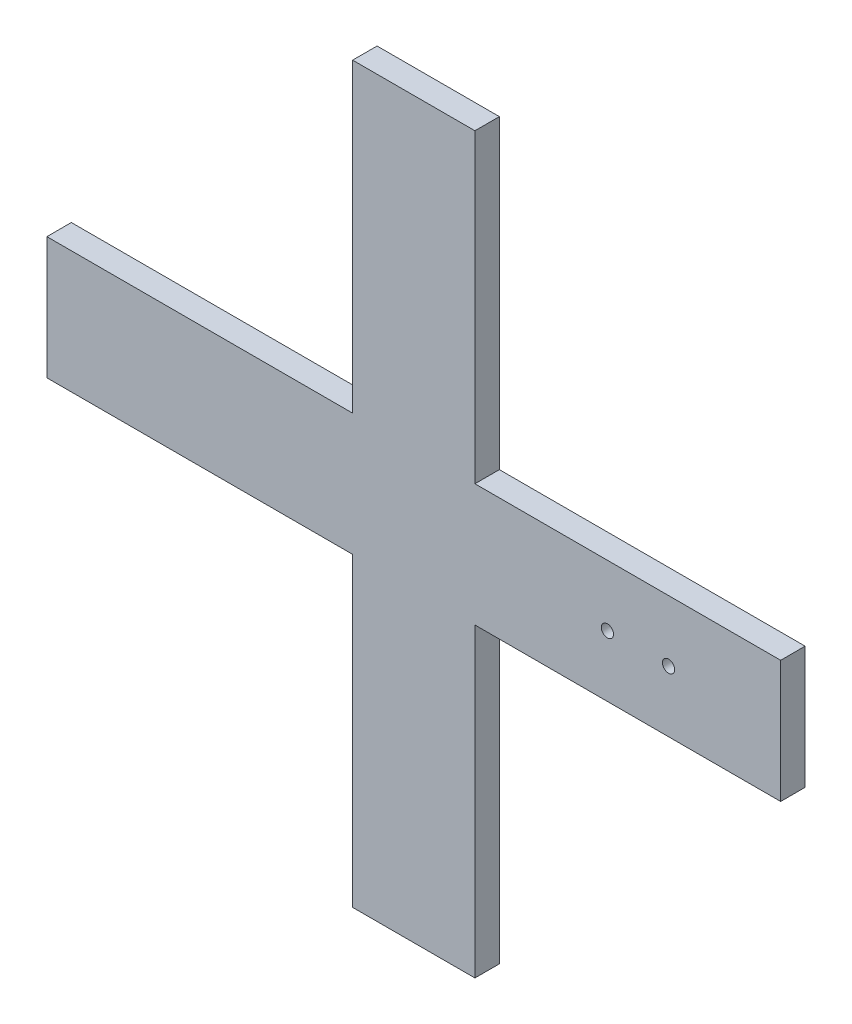
ISO-10303-21;
HEADER;
FILE_DESCRIPTION(('STEP AP214'),'2;1');
FILE_NAME('part.step','',(''),(''),'','','');
FILE_SCHEMA(('AUTOMOTIVE_DESIGN { 1 0 10303 214 1 1 1 1 }'));
ENDSEC;
DATA;
#1=APPLICATION_CONTEXT('core data for automotive mechanical design processes');
#2=APPLICATION_PROTOCOL_DEFINITION('international standard','automotive_design',2000,#1);
#3=PRODUCT_CONTEXT('',#1,'mechanical');
#4=PRODUCT('Part','Part','',(#3));
#5=PRODUCT_RELATED_PRODUCT_CATEGORY('part','',(#4));
#6=PRODUCT_DEFINITION_FORMATION('','',#4);
#7=PRODUCT_DEFINITION_CONTEXT('part definition',#1,'design');
#8=PRODUCT_DEFINITION('design','',#6,#7);
#9=PRODUCT_DEFINITION_SHAPE('','',#8);
#10=(LENGTH_UNIT() NAMED_UNIT(*) SI_UNIT(.MILLI.,.METRE.));
#11=(NAMED_UNIT(*) PLANE_ANGLE_UNIT() SI_UNIT($,.RADIAN.));
#12=(NAMED_UNIT(*) SI_UNIT($,.STERADIAN.) SOLID_ANGLE_UNIT());
#13=UNCERTAINTY_MEASURE_WITH_UNIT(LENGTH_MEASURE(1.E-05),#10,'distance_accuracy_value','');
#14=(GEOMETRIC_REPRESENTATION_CONTEXT(3) GLOBAL_UNCERTAINTY_ASSIGNED_CONTEXT((#13)) GLOBAL_UNIT_ASSIGNED_CONTEXT((#10,
#11,#12)) REPRESENTATION_CONTEXT('',''));
#15=CARTESIAN_POINT('',(0.,0.,0.));
#16=DIRECTION('',(0.,0.,1.));
#17=DIRECTION('',(1.,0.,0.));
#18=AXIS2_PLACEMENT_3D('',#15,#16,#17);
#19=CARTESIAN_POINT('',(0.,75.,6.));
#20=DIRECTION('',(0.,1.,0.));
#21=DIRECTION('',(0.,0.,1.));
#22=AXIS2_PLACEMENT_3D('',#19,#20,#21);
#23=PLANE('',#22);
#24=DIRECTION('',(1.,0.,0.));
#25=VECTOR('',#24,1.);
#26=CARTESIAN_POINT('',(0.,75.,0.));
#27=LINE('',#26,#25);
#28=CARTESIAN_POINT('',(0.,75.,0.));
#29=VERTEX_POINT('',#28);
#30=CARTESIAN_POINT('',(75.0000000000011,75.,0.));
#31=VERTEX_POINT('',#30);
#32=EDGE_CURVE('E167',#29,#31,#27,.T.);
#33=ORIENTED_EDGE('',*,*,#32,.T.);
#34=DIRECTION('',(0.,0.,-1.));
#35=VECTOR('',#34,1.);
#36=CARTESIAN_POINT('',(75.0000000000011,75.,6.));
#37=LINE('',#36,#35);
#38=CARTESIAN_POINT('',(75.0000000000011,75.,6.));
#39=VERTEX_POINT('',#38);
#40=EDGE_CURVE('E11',#39,#31,#37,.T.);
#41=ORIENTED_EDGE('',*,*,#40,.F.);
#42=DIRECTION('',(1.,0.,0.));
#43=VECTOR('',#42,1.);
#44=CARTESIAN_POINT('',(0.,75.,6.));
#45=LINE('',#44,#43);
#46=CARTESIAN_POINT('',(0.,75.,6.));
#47=VERTEX_POINT('',#46);
#48=EDGE_CURVE('E403',#47,#39,#45,.T.);
#49=ORIENTED_EDGE('',*,*,#48,.F.);
#50=DIRECTION('',(0.,0.,-1.));
#51=VECTOR('',#50,1.);
#52=CARTESIAN_POINT('',(0.,75.,6.));
#53=LINE('',#52,#51);
#54=EDGE_CURVE('E56',#47,#29,#53,.T.);
#55=ORIENTED_EDGE('',*,*,#54,.T.);
#56=EDGE_LOOP('',(#33,#41,#49,#55));
#57=FACE_BOUND('',#56,.T.);
#58=ADVANCED_FACE('F39',(#57),#23,.F.);
#59=CARTESIAN_POINT('',(75.0000000000011,0.,6.));
#60=DIRECTION('',(1.,0.,0.));
#61=DIRECTION('',(0.,0.,-1.));
#62=AXIS2_PLACEMENT_3D('',#59,#60,#61);
#63=PLANE('',#62);
#64=DIRECTION('',(0.,-1.,0.));
#65=VECTOR('',#64,1.);
#66=CARTESIAN_POINT('',(75.0000000000011,0.,0.));
#67=LINE('',#66,#65);
#68=CARTESIAN_POINT('',(75.0000000000011,0.,0.));
#69=VERTEX_POINT('',#68);
#70=EDGE_CURVE('E169',#31,#69,#67,.T.);
#71=ORIENTED_EDGE('',*,*,#70,.T.);
#72=DIRECTION('',(0.,0.,-1.));
#73=VECTOR('',#72,1.);
#74=CARTESIAN_POINT('',(75.0000000000011,0.,6.));
#75=LINE('',#74,#73);
#76=CARTESIAN_POINT('',(75.0000000000011,0.,6.));
#77=VERTEX_POINT('',#76);
#78=EDGE_CURVE('E48',#77,#69,#75,.T.);
#79=ORIENTED_EDGE('',*,*,#78,.F.);
#80=DIRECTION('',(0.,-1.,0.));
#81=VECTOR('',#80,1.);
#82=CARTESIAN_POINT('',(75.0000000000011,0.,6.));
#83=LINE('',#82,#81);
#84=EDGE_CURVE('E106',#39,#77,#83,.T.);
#85=ORIENTED_EDGE('',*,*,#84,.F.);
#86=ORIENTED_EDGE('',*,*,#40,.T.);
#87=EDGE_LOOP('',(#71,#79,#85,#86));
#88=FACE_BOUND('',#87,.T.);
#89=ADVANCED_FACE('F262',(#88),#63,.F.);
#90=CARTESIAN_POINT('',(0.,0.,6.));
#91=DIRECTION('',(0.,1.,0.));
#92=DIRECTION('',(0.,0.,1.));
#93=AXIS2_PLACEMENT_3D('',#90,#91,#92);
#94=PLANE('',#93);
#95=DIRECTION('',(1.,0.,0.));
#96=VECTOR('',#95,1.);
#97=CARTESIAN_POINT('',(0.,0.,0.));
#98=LINE('',#97,#96);
#99=CARTESIAN_POINT('',(105.000000000001,0.,0.));
#100=VERTEX_POINT('',#99);
#101=EDGE_CURVE('E171',#69,#100,#98,.T.);
#102=ORIENTED_EDGE('',*,*,#101,.T.);
#103=DIRECTION('',(0.,0.,-1.));
#104=VECTOR('',#103,1.);
#105=CARTESIAN_POINT('',(105.000000000001,0.,6.));
#106=LINE('',#105,#104);
#107=CARTESIAN_POINT('',(105.000000000001,0.,6.));
#108=VERTEX_POINT('',#107);
#109=EDGE_CURVE('E212',#108,#100,#106,.T.);
#110=ORIENTED_EDGE('',*,*,#109,.F.);
#111=DIRECTION('',(1.,0.,0.));
#112=VECTOR('',#111,1.);
#113=CARTESIAN_POINT('',(0.,0.,6.));
#114=LINE('',#113,#112);
#115=EDGE_CURVE('E219',#77,#108,#114,.T.);
#116=ORIENTED_EDGE('',*,*,#115,.F.);
#117=ORIENTED_EDGE('',*,*,#78,.T.);
#118=EDGE_LOOP('',(#102,#110,#116,#117));
#119=FACE_BOUND('',#118,.T.);
#120=ADVANCED_FACE('F217',(#119),#94,.F.);
#121=CARTESIAN_POINT('',(105.000000000001,0.,6.));
#122=DIRECTION('',(1.,0.,0.));
#123=DIRECTION('',(0.,0.,-1.));
#124=AXIS2_PLACEMENT_3D('',#121,#122,#123);
#125=PLANE('',#124);
#126=DIRECTION('',(0.,-1.,0.));
#127=VECTOR('',#126,1.);
#128=CARTESIAN_POINT('',(105.000000000001,0.,0.));
#129=LINE('',#128,#127);
#130=CARTESIAN_POINT('',(105.000000000001,75.,0.));
#131=VERTEX_POINT('',#130);
#132=EDGE_CURVE('E174',#131,#100,#129,.T.);
#133=ORIENTED_EDGE('',*,*,#132,.F.);
#134=DIRECTION('',(0.,0.,-1.));
#135=VECTOR('',#134,1.);
#136=CARTESIAN_POINT('',(105.000000000001,75.,6.));
#137=LINE('',#136,#135);
#138=CARTESIAN_POINT('',(105.000000000001,75.,6.));
#139=VERTEX_POINT('',#138);
#140=EDGE_CURVE('E210',#139,#131,#137,.T.);
#141=ORIENTED_EDGE('',*,*,#140,.F.);
#142=DIRECTION('',(0.,-1.,0.));
#143=VECTOR('',#142,1.);
#144=CARTESIAN_POINT('',(105.000000000001,0.,6.));
#145=LINE('',#144,#143);
#146=EDGE_CURVE('E230',#139,#108,#145,.T.);
#147=ORIENTED_EDGE('',*,*,#146,.T.);
#148=ORIENTED_EDGE('',*,*,#109,.T.);
#149=EDGE_LOOP('',(#133,#141,#147,#148));
#150=FACE_BOUND('',#149,.T.);
#151=ADVANCED_FACE('F226',(#150),#125,.T.);
#152=CARTESIAN_POINT('',(0.,75.,6.));
#153=DIRECTION('',(0.,1.,0.));
#154=DIRECTION('',(0.,0.,1.));
#155=AXIS2_PLACEMENT_3D('',#152,#153,#154);
#156=PLANE('',#155);
#157=DIRECTION('',(1.,0.,0.));
#158=VECTOR('',#157,1.);
#159=CARTESIAN_POINT('',(0.,75.,0.));
#160=LINE('',#159,#158);
#161=CARTESIAN_POINT('',(180.,75.,0.));
#162=VERTEX_POINT('',#161);
#163=EDGE_CURVE('E177',#131,#162,#160,.T.);
#164=ORIENTED_EDGE('',*,*,#163,.T.);
#165=DIRECTION('',(0.,0.,-1.));
#166=VECTOR('',#165,1.);
#167=CARTESIAN_POINT('',(180.,75.,6.));
#168=LINE('',#167,#166);
#169=CARTESIAN_POINT('',(180.,75.,6.));
#170=VERTEX_POINT('',#169);
#171=EDGE_CURVE('E207',#170,#162,#168,.T.);
#172=ORIENTED_EDGE('',*,*,#171,.F.);
#173=DIRECTION('',(1.,0.,0.));
#174=VECTOR('',#173,1.);
#175=CARTESIAN_POINT('',(0.,75.,6.));
#176=LINE('',#175,#174);
#177=EDGE_CURVE('E231',#139,#170,#176,.T.);
#178=ORIENTED_EDGE('',*,*,#177,.F.);
#179=ORIENTED_EDGE('',*,*,#140,.T.);
#180=EDGE_LOOP('',(#164,#172,#178,#179));
#181=FACE_BOUND('',#180,.T.);
#182=ADVANCED_FACE('F356',(#181),#156,.F.);
#183=CARTESIAN_POINT('',(180.,0.,6.));
#184=DIRECTION('',(-1.,0.,0.));
#185=DIRECTION('',(0.,0.,1.));
#186=AXIS2_PLACEMENT_3D('',#183,#184,#185);
#187=PLANE('',#186);
#188=DIRECTION('',(0.,1.,0.));
#189=VECTOR('',#188,1.);
#190=CARTESIAN_POINT('',(180.,0.,0.));
#191=LINE('',#190,#189);
#192=CARTESIAN_POINT('',(180.,105.,0.));
#193=VERTEX_POINT('',#192);
#194=EDGE_CURVE('E179',#162,#193,#191,.T.);
#195=ORIENTED_EDGE('',*,*,#194,.T.);
#196=DIRECTION('',(0.,0.,-1.));
#197=VECTOR('',#196,1.);
#198=CARTESIAN_POINT('',(180.,105.,6.));
#199=LINE('',#198,#197);
#200=CARTESIAN_POINT('',(180.,105.,6.));
#201=VERTEX_POINT('',#200);
#202=EDGE_CURVE('E205',#201,#193,#199,.T.);
#203=ORIENTED_EDGE('',*,*,#202,.F.);
#204=DIRECTION('',(0.,1.,0.));
#205=VECTOR('',#204,1.);
#206=CARTESIAN_POINT('',(180.,0.,6.));
#207=LINE('',#206,#205);
#208=EDGE_CURVE('E233',#170,#201,#207,.T.);
#209=ORIENTED_EDGE('',*,*,#208,.F.);
#210=ORIENTED_EDGE('',*,*,#171,.T.);
#211=EDGE_LOOP('',(#195,#203,#209,#210));
#212=FACE_BOUND('',#211,.T.);
#213=ADVANCED_FACE('F346',(#212),#187,.F.);
#214=CARTESIAN_POINT('',(0.,105.,6.));
#215=DIRECTION('',(0.,1.,0.));
#216=DIRECTION('',(0.,0.,1.));
#217=AXIS2_PLACEMENT_3D('',#214,#215,#216);
#218=PLANE('',#217);
#219=DIRECTION('',(1.,0.,0.));
#220=VECTOR('',#219,1.);
#221=CARTESIAN_POINT('',(0.,105.,0.));
#222=LINE('',#221,#220);
#223=CARTESIAN_POINT('',(105.,105.,0.));
#224=VERTEX_POINT('',#223);
#225=EDGE_CURVE('E182',#224,#193,#222,.T.);
#226=ORIENTED_EDGE('',*,*,#225,.F.);
#227=DIRECTION('',(0.,0.,-1.));
#228=VECTOR('',#227,1.);
#229=CARTESIAN_POINT('',(105.,105.,6.));
#230=LINE('',#229,#228);
#231=CARTESIAN_POINT('',(105.,105.,6.));
#232=VERTEX_POINT('',#231);
#233=EDGE_CURVE('E203',#232,#224,#230,.T.);
#234=ORIENTED_EDGE('',*,*,#233,.F.);
#235=DIRECTION('',(1.,0.,0.));
#236=VECTOR('',#235,1.);
#237=CARTESIAN_POINT('',(0.,105.,6.));
#238=LINE('',#237,#236);
#239=EDGE_CURVE('E239',#232,#201,#238,.T.);
#240=ORIENTED_EDGE('',*,*,#239,.T.);
#241=ORIENTED_EDGE('',*,*,#202,.T.);
#242=EDGE_LOOP('',(#226,#234,#240,#241));
#243=FACE_BOUND('',#242,.T.);
#244=ADVANCED_FACE('F336',(#243),#218,.T.);
#245=CARTESIAN_POINT('',(105.,0.,6.));
#246=DIRECTION('',(1.,0.,0.));
#247=DIRECTION('',(0.,0.,-1.));
#248=AXIS2_PLACEMENT_3D('',#245,#246,#247);
#249=PLANE('',#248);
#250=DIRECTION('',(0.,-1.,0.));
#251=VECTOR('',#250,1.);
#252=CARTESIAN_POINT('',(105.,0.,0.));
#253=LINE('',#252,#251);
#254=CARTESIAN_POINT('',(105.,180.,0.));
#255=VERTEX_POINT('',#254);
#256=EDGE_CURVE('E185',#255,#224,#253,.T.);
#257=ORIENTED_EDGE('',*,*,#256,.F.);
#258=DIRECTION('',(0.,0.,-1.));
#259=VECTOR('',#258,1.);
#260=CARTESIAN_POINT('',(105.,180.,6.));
#261=LINE('',#260,#259);
#262=CARTESIAN_POINT('',(105.,180.,6.));
#263=VERTEX_POINT('',#262);
#264=EDGE_CURVE('E201',#263,#255,#261,.T.);
#265=ORIENTED_EDGE('',*,*,#264,.F.);
#266=DIRECTION('',(0.,-1.,0.));
#267=VECTOR('',#266,1.);
#268=CARTESIAN_POINT('',(105.,0.,6.));
#269=LINE('',#268,#267);
#270=EDGE_CURVE('E242',#263,#232,#269,.T.);
#271=ORIENTED_EDGE('',*,*,#270,.T.);
#272=ORIENTED_EDGE('',*,*,#233,.T.);
#273=EDGE_LOOP('',(#257,#265,#271,#272));
#274=FACE_BOUND('',#273,.T.);
#275=ADVANCED_FACE('F327',(#274),#249,.T.);
#276=CARTESIAN_POINT('',(0.,180.,6.));
#277=DIRECTION('',(0.,1.,0.));
#278=DIRECTION('',(-1.,0.,0.));
#279=AXIS2_PLACEMENT_3D('',#276,#277,#278);
#280=PLANE('',#279);
#281=DIRECTION('',(1.,0.,0.));
#282=VECTOR('',#281,1.);
#283=CARTESIAN_POINT('',(0.,180.,0.));
#284=LINE('',#283,#282);
#285=CARTESIAN_POINT('',(75.,180.,0.));
#286=VERTEX_POINT('',#285);
#287=EDGE_CURVE('E188',#286,#255,#284,.T.);
#288=ORIENTED_EDGE('',*,*,#287,.F.);
#289=DIRECTION('',(0.,0.,-1.));
#290=VECTOR('',#289,1.);
#291=CARTESIAN_POINT('',(75.,180.,6.));
#292=LINE('',#291,#290);
#293=CARTESIAN_POINT('',(75.,180.,6.));
#294=VERTEX_POINT('',#293);
#295=EDGE_CURVE('E153',#294,#286,#292,.T.);
#296=ORIENTED_EDGE('',*,*,#295,.F.);
#297=DIRECTION('',(1.,0.,0.));
#298=VECTOR('',#297,1.);
#299=CARTESIAN_POINT('',(0.,180.,6.));
#300=LINE('',#299,#298);
#301=EDGE_CURVE('E143',#294,#263,#300,.T.);
#302=ORIENTED_EDGE('',*,*,#301,.T.);
#303=ORIENTED_EDGE('',*,*,#264,.T.);
#304=EDGE_LOOP('',(#288,#296,#302,#303));
#305=FACE_BOUND('',#304,.T.);
#306=ADVANCED_FACE('F246',(#305),#280,.T.);
#307=CARTESIAN_POINT('',(75.,0.,6.));
#308=DIRECTION('',(1.,0.,0.));
#309=DIRECTION('',(0.,0.,-1.));
#310=AXIS2_PLACEMENT_3D('',#307,#308,#309);
#311=PLANE('',#310);
#312=DIRECTION('',(0.,-1.,0.));
#313=VECTOR('',#312,1.);
#314=CARTESIAN_POINT('',(75.,0.,0.));
#315=LINE('',#314,#313);
#316=CARTESIAN_POINT('',(75.,105.,0.));
#317=VERTEX_POINT('',#316);
#318=EDGE_CURVE('E150',#286,#317,#315,.T.);
#319=ORIENTED_EDGE('',*,*,#318,.T.);
#320=DIRECTION('',(0.,0.,-1.));
#321=VECTOR('',#320,1.);
#322=CARTESIAN_POINT('',(75.,105.,6.));
#323=LINE('',#322,#321);
#324=CARTESIAN_POINT('',(75.,105.,6.));
#325=VERTEX_POINT('',#324);
#326=EDGE_CURVE('E147',#325,#317,#323,.T.);
#327=ORIENTED_EDGE('',*,*,#326,.F.);
#328=DIRECTION('',(0.,-1.,0.));
#329=VECTOR('',#328,1.);
#330=CARTESIAN_POINT('',(75.,0.,6.));
#331=LINE('',#330,#329);
#332=EDGE_CURVE('E135',#294,#325,#331,.T.);
#333=ORIENTED_EDGE('',*,*,#332,.F.);
#334=ORIENTED_EDGE('',*,*,#295,.T.);
#335=EDGE_LOOP('',(#319,#327,#333,#334));
#336=FACE_BOUND('',#335,.T.);
#337=ADVANCED_FACE('F148',(#336),#311,.F.);
#338=CARTESIAN_POINT('',(0.,105.,6.));
#339=DIRECTION('',(0.,1.,0.));
#340=DIRECTION('',(0.,0.,1.));
#341=AXIS2_PLACEMENT_3D('',#338,#339,#340);
#342=PLANE('',#341);
#343=DIRECTION('',(1.,0.,0.));
#344=VECTOR('',#343,1.);
#345=CARTESIAN_POINT('',(0.,105.,0.));
#346=LINE('',#345,#344);
#347=CARTESIAN_POINT('',(0.,105.,0.));
#348=VERTEX_POINT('',#347);
#349=EDGE_CURVE('E192',#348,#317,#346,.T.);
#350=ORIENTED_EDGE('',*,*,#349,.F.);
#351=DIRECTION('',(0.,0.,-1.));
#352=VECTOR('',#351,1.);
#353=CARTESIAN_POINT('',(0.,105.,6.));
#354=LINE('',#353,#352);
#355=CARTESIAN_POINT('',(0.,105.,6.));
#356=VERTEX_POINT('',#355);
#357=EDGE_CURVE('E94',#356,#348,#354,.T.);
#358=ORIENTED_EDGE('',*,*,#357,.F.);
#359=DIRECTION('',(1.,0.,0.));
#360=VECTOR('',#359,1.);
#361=CARTESIAN_POINT('',(0.,105.,6.));
#362=LINE('',#361,#360);
#363=EDGE_CURVE('E140',#356,#325,#362,.T.);
#364=ORIENTED_EDGE('',*,*,#363,.T.);
#365=ORIENTED_EDGE('',*,*,#326,.T.);
#366=EDGE_LOOP('',(#350,#358,#364,#365));
#367=FACE_BOUND('',#366,.T.);
#368=ADVANCED_FACE('F155',(#367),#342,.T.);
#369=CARTESIAN_POINT('',(137.5,89.9999999999999,6.));
#370=DIRECTION('',(0.,0.,-1.));
#371=DIRECTION('',(-1.,0.,0.));
#372=AXIS2_PLACEMENT_3D('',#369,#370,#371);
#373=CYLINDRICAL_SURFACE('',#372,1.5);
#374=CARTESIAN_POINT('',(137.5,89.9999999999999,6.));
#375=DIRECTION('',(0.,0.,1.));
#376=DIRECTION('',(1.,0.,0.));
#377=AXIS2_PLACEMENT_3D('',#374,#375,#376);
#378=CIRCLE('',#377,1.5);
#379=CARTESIAN_POINT('',(139.,89.9999999999999,6.));
#380=VERTEX_POINT('',#379);
#381=EDGE_CURVE('E277',#380,#380,#378,.T.);
#382=ORIENTED_EDGE('',*,*,#381,.T.);
#383=EDGE_LOOP('',(#382));
#384=FACE_BOUND('',#383,.T.);
#385=CARTESIAN_POINT('',(137.5,89.9999999999999,0.));
#386=DIRECTION('',(0.,0.,1.));
#387=DIRECTION('',(1.,0.,0.));
#388=AXIS2_PLACEMENT_3D('',#385,#386,#387);
#389=CIRCLE('',#388,1.5);
#390=CARTESIAN_POINT('',(139.,89.9999999999999,0.));
#391=VERTEX_POINT('',#390);
#392=EDGE_CURVE('E164',#391,#391,#389,.T.);
#393=ORIENTED_EDGE('',*,*,#392,.F.);
#394=EDGE_LOOP('',(#393));
#395=FACE_BOUND('',#394,.T.);
#396=ADVANCED_FACE('F257',(#384,#395),#373,.F.);
#397=CARTESIAN_POINT('',(152.5,89.9999999999999,6.));
#398=DIRECTION('',(0.,0.,-1.));
#399=DIRECTION('',(-1.,0.,0.));
#400=AXIS2_PLACEMENT_3D('',#397,#398,#399);
#401=CYLINDRICAL_SURFACE('',#400,1.5);
#402=CARTESIAN_POINT('',(152.5,89.9999999999999,6.));
#403=DIRECTION('',(0.,0.,1.));
#404=DIRECTION('',(1.,0.,0.));
#405=AXIS2_PLACEMENT_3D('',#402,#403,#404);
#406=CIRCLE('',#405,1.5);
#407=CARTESIAN_POINT('',(154.,89.9999999999999,6.));
#408=VERTEX_POINT('',#407);
#409=EDGE_CURVE('E197',#408,#408,#406,.T.);
#410=ORIENTED_EDGE('',*,*,#409,.T.);
#411=EDGE_LOOP('',(#410));
#412=FACE_BOUND('',#411,.T.);
#413=CARTESIAN_POINT('',(152.5,89.9999999999999,0.));
#414=DIRECTION('',(0.,0.,1.));
#415=DIRECTION('',(1.,0.,0.));
#416=AXIS2_PLACEMENT_3D('',#413,#414,#415);
#417=CIRCLE('',#416,1.5);
#418=CARTESIAN_POINT('',(154.,89.9999999999999,0.));
#419=VERTEX_POINT('',#418);
#420=EDGE_CURVE('E161',#419,#419,#417,.T.);
#421=ORIENTED_EDGE('',*,*,#420,.F.);
#422=EDGE_LOOP('',(#421));
#423=FACE_BOUND('',#422,.T.);
#424=ADVANCED_FACE('F41',(#412,#423),#401,.F.);
#425=CARTESIAN_POINT('',(0.,0.,6.));
#426=DIRECTION('',(-1.,0.,0.));
#427=DIRECTION('',(0.,0.,1.));
#428=AXIS2_PLACEMENT_3D('',#425,#426,#427);
#429=PLANE('',#428);
#430=DIRECTION('',(0.,1.,0.));
#431=VECTOR('',#430,1.);
#432=CARTESIAN_POINT('',(0.,0.,0.));
#433=LINE('',#432,#431);
#434=EDGE_CURVE('E194',#29,#348,#433,.T.);
#435=ORIENTED_EDGE('',*,*,#434,.F.);
#436=ORIENTED_EDGE('',*,*,#54,.F.);
#437=DIRECTION('',(0.,1.,0.));
#438=VECTOR('',#437,1.);
#439=CARTESIAN_POINT('',(0.,0.,6.));
#440=LINE('',#439,#438);
#441=EDGE_CURVE('E156',#47,#356,#440,.T.);
#442=ORIENTED_EDGE('',*,*,#441,.T.);
#443=ORIENTED_EDGE('',*,*,#357,.T.);
#444=EDGE_LOOP('',(#435,#436,#442,#443));
#445=FACE_BOUND('',#444,.T.);
#446=ADVANCED_FACE('F248',(#445),#429,.T.);
#447=CARTESIAN_POINT('',(0.,0.,6.));
#448=DIRECTION('',(0.,0.,1.));
#449=DIRECTION('',(1.,0.,0.));
#450=AXIS2_PLACEMENT_3D('',#447,#448,#449);
#451=PLANE('',#450);
#452=ORIENTED_EDGE('',*,*,#409,.F.);
#453=EDGE_LOOP('',(#452));
#454=FACE_BOUND('',#453,.T.);
#455=ORIENTED_EDGE('',*,*,#381,.F.);
#456=EDGE_LOOP('',(#455));
#457=FACE_BOUND('',#456,.T.);
#458=ORIENTED_EDGE('',*,*,#48,.T.);
#459=ORIENTED_EDGE('',*,*,#84,.T.);
#460=ORIENTED_EDGE('',*,*,#115,.T.);
#461=ORIENTED_EDGE('',*,*,#146,.F.);
#462=ORIENTED_EDGE('',*,*,#177,.T.);
#463=ORIENTED_EDGE('',*,*,#208,.T.);
#464=ORIENTED_EDGE('',*,*,#239,.F.);
#465=ORIENTED_EDGE('',*,*,#270,.F.);
#466=ORIENTED_EDGE('',*,*,#301,.F.);
#467=ORIENTED_EDGE('',*,*,#332,.T.);
#468=ORIENTED_EDGE('',*,*,#363,.F.);
#469=ORIENTED_EDGE('',*,*,#441,.F.);
#470=EDGE_LOOP('',(#458,#459,#460,#461,#462,#463,#464,#465,#466,#467,#468,#469));
#471=FACE_BOUND('',#470,.T.);
#472=ADVANCED_FACE('F137',(#454,#457,#471),#451,.T.);
#473=CARTESIAN_POINT('',(0.,0.,0.));
#474=DIRECTION('',(0.,0.,1.));
#475=DIRECTION('',(1.,0.,0.));
#476=AXIS2_PLACEMENT_3D('',#473,#474,#475);
#477=PLANE('',#476);
#478=ORIENTED_EDGE('',*,*,#420,.T.);
#479=EDGE_LOOP('',(#478));
#480=FACE_BOUND('',#479,.T.);
#481=ORIENTED_EDGE('',*,*,#392,.T.);
#482=EDGE_LOOP('',(#481));
#483=FACE_BOUND('',#482,.T.);
#484=ORIENTED_EDGE('',*,*,#32,.F.);
#485=ORIENTED_EDGE('',*,*,#434,.T.);
#486=ORIENTED_EDGE('',*,*,#349,.T.);
#487=ORIENTED_EDGE('',*,*,#318,.F.);
#488=ORIENTED_EDGE('',*,*,#287,.T.);
#489=ORIENTED_EDGE('',*,*,#256,.T.);
#490=ORIENTED_EDGE('',*,*,#225,.T.);
#491=ORIENTED_EDGE('',*,*,#194,.F.);
#492=ORIENTED_EDGE('',*,*,#163,.F.);
#493=ORIENTED_EDGE('',*,*,#132,.T.);
#494=ORIENTED_EDGE('',*,*,#101,.F.);
#495=ORIENTED_EDGE('',*,*,#70,.F.);
#496=EDGE_LOOP('',(#484,#485,#486,#487,#488,#489,#490,#491,#492,#493,#494,#495));
#497=FACE_BOUND('',#496,.T.);
#498=ADVANCED_FACE('F221',(#480,#483,#497),#477,.F.);
#499=CLOSED_SHELL('',(#58,#89,#120,#151,#182,#213,#244,#275,#306,#337,#368,#396,#424,#446,#472,#498));
#500=MANIFOLD_SOLID_BREP('B2',#499);
#501=ADVANCED_BREP_SHAPE_REPRESENTATION('',(#18,#500),#14);
#502=SHAPE_DEFINITION_REPRESENTATION(#9,#501);
ENDSEC;
END-ISO-10303-21;
